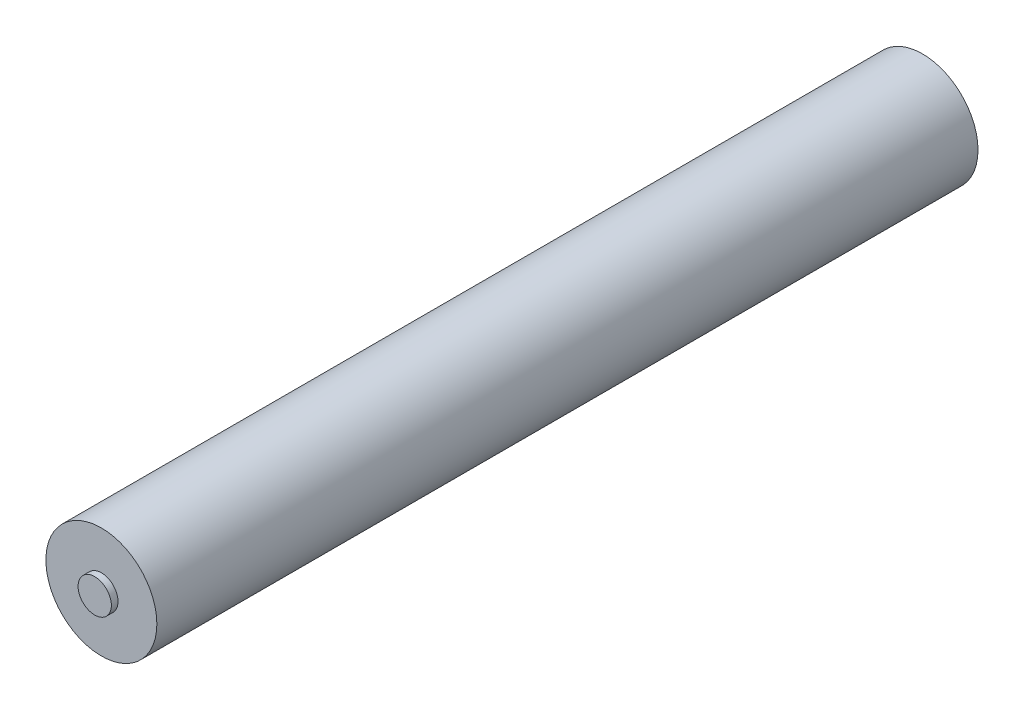
ISO-10303-21;
HEADER;
FILE_DESCRIPTION(('STEP AP214'),'2;1');
FILE_NAME('part.step','',(''),(''),'','','');
FILE_SCHEMA(('AUTOMOTIVE_DESIGN { 1 0 10303 214 1 1 1 1 }'));
ENDSEC;
DATA;
#1=APPLICATION_CONTEXT('core data for automotive mechanical design processes');
#2=APPLICATION_PROTOCOL_DEFINITION('international standard','automotive_design',2000,#1);
#3=PRODUCT_CONTEXT('',#1,'mechanical');
#4=PRODUCT('Part','Part','',(#3));
#5=PRODUCT_RELATED_PRODUCT_CATEGORY('part','',(#4));
#6=PRODUCT_DEFINITION_FORMATION('','',#4);
#7=PRODUCT_DEFINITION_CONTEXT('part definition',#1,'design');
#8=PRODUCT_DEFINITION('design','',#6,#7);
#9=PRODUCT_DEFINITION_SHAPE('','',#8);
#10=(LENGTH_UNIT() NAMED_UNIT(*) SI_UNIT(.MILLI.,.METRE.));
#11=(NAMED_UNIT(*) PLANE_ANGLE_UNIT() SI_UNIT($,.RADIAN.));
#12=(NAMED_UNIT(*) SI_UNIT($,.STERADIAN.) SOLID_ANGLE_UNIT());
#13=UNCERTAINTY_MEASURE_WITH_UNIT(LENGTH_MEASURE(1.E-05),#10,'distance_accuracy_value','');
#14=(GEOMETRIC_REPRESENTATION_CONTEXT(3) GLOBAL_UNCERTAINTY_ASSIGNED_CONTEXT((#13)) GLOBAL_UNIT_ASSIGNED_CONTEXT((#10,
#11,#12)) REPRESENTATION_CONTEXT('',''));
#15=CARTESIAN_POINT('',(0.,0.,0.));
#16=DIRECTION('',(0.,0.,1.));
#17=DIRECTION('',(1.,0.,0.));
#18=AXIS2_PLACEMENT_3D('',#15,#16,#17);
#19=CARTESIAN_POINT('',(0.,0.,370.));
#20=DIRECTION('',(0.,0.,-1.));
#21=DIRECTION('',(-1.,0.,0.));
#22=AXIS2_PLACEMENT_3D('',#19,#20,#21);
#23=CYLINDRICAL_SURFACE('',#22,25.);
#24=CARTESIAN_POINT('',(0.,0.,370.));
#25=DIRECTION('',(0.,0.,1.));
#26=DIRECTION('',(1.,0.,0.));
#27=AXIS2_PLACEMENT_3D('',#24,#25,#26);
#28=CIRCLE('',#27,25.);
#29=CARTESIAN_POINT('',(25.,0.,370.));
#30=VERTEX_POINT('',#29);
#31=EDGE_CURVE('E10',#30,#30,#28,.T.);
#32=ORIENTED_EDGE('',*,*,#31,.F.);
#33=EDGE_LOOP('',(#32));
#34=FACE_BOUND('',#33,.T.);
#35=CARTESIAN_POINT('',(0.,0.,0.));
#36=DIRECTION('',(0.,0.,1.));
#37=DIRECTION('',(1.,0.,0.));
#38=AXIS2_PLACEMENT_3D('',#35,#36,#37);
#39=CIRCLE('',#38,25.);
#40=CARTESIAN_POINT('',(25.,0.,0.));
#41=VERTEX_POINT('',#40);
#42=EDGE_CURVE('E34',#41,#41,#39,.T.);
#43=ORIENTED_EDGE('',*,*,#42,.T.);
#44=EDGE_LOOP('',(#43));
#45=FACE_BOUND('',#44,.T.);
#46=ADVANCED_FACE('F31',(#34,#45),#23,.T.);
#47=CARTESIAN_POINT('',(0.,0.,370.));
#48=DIRECTION('',(0.,0.,1.));
#49=DIRECTION('',(1.,0.,0.));
#50=AXIS2_PLACEMENT_3D('',#47,#48,#49);
#51=PLANE('',#50);
#52=CARTESIAN_POINT('',(0.,0.,370.));
#53=DIRECTION('',(0.,0.,1.));
#54=DIRECTION('',(1.,0.,0.));
#55=AXIS2_PLACEMENT_3D('',#52,#53,#54);
#56=CIRCLE('',#55,7.5);
#57=CARTESIAN_POINT('',(7.5,0.,370.));
#58=VERTEX_POINT('',#57);
#59=EDGE_CURVE('E43',#58,#58,#56,.T.);
#60=ORIENTED_EDGE('',*,*,#59,.F.);
#61=EDGE_LOOP('',(#60));
#62=FACE_BOUND('',#61,.T.);
#63=ORIENTED_EDGE('',*,*,#31,.T.);
#64=EDGE_LOOP('',(#63));
#65=FACE_BOUND('',#64,.T.);
#66=ADVANCED_FACE('F58',(#62,#65),#51,.T.);
#67=CARTESIAN_POINT('',(0.,0.,0.));
#68=DIRECTION('',(0.,0.,1.));
#69=DIRECTION('',(1.,0.,0.));
#70=AXIS2_PLACEMENT_3D('',#67,#68,#69);
#71=PLANE('',#70);
#72=ORIENTED_EDGE('',*,*,#42,.F.);
#73=EDGE_LOOP('',(#72));
#74=FACE_BOUND('',#73,.T.);
#75=ADVANCED_FACE('F54',(#74),#71,.F.);
#76=CARTESIAN_POINT('',(0.,0.,373.));
#77=DIRECTION('',(0.,0.,-1.));
#78=DIRECTION('',(-1.,0.,0.));
#79=AXIS2_PLACEMENT_3D('',#76,#77,#78);
#80=CYLINDRICAL_SURFACE('',#79,7.5);
#81=CARTESIAN_POINT('',(0.,0.,373.));
#82=DIRECTION('',(0.,0.,1.));
#83=DIRECTION('',(1.,0.,0.));
#84=AXIS2_PLACEMENT_3D('',#81,#82,#83);
#85=CIRCLE('',#84,7.5);
#86=CARTESIAN_POINT('',(7.5,0.,373.));
#87=VERTEX_POINT('',#86);
#88=EDGE_CURVE('E41',#87,#87,#85,.T.);
#89=ORIENTED_EDGE('',*,*,#88,.F.);
#90=EDGE_LOOP('',(#89));
#91=FACE_BOUND('',#90,.T.);
#92=ORIENTED_EDGE('',*,*,#59,.T.);
#93=EDGE_LOOP('',(#92));
#94=FACE_BOUND('',#93,.T.);
#95=ADVANCED_FACE('F51',(#91,#94),#80,.T.);
#96=CARTESIAN_POINT('',(0.,0.,373.));
#97=DIRECTION('',(0.,0.,1.));
#98=DIRECTION('',(1.,0.,0.));
#99=AXIS2_PLACEMENT_3D('',#96,#97,#98);
#100=PLANE('',#99);
#101=ORIENTED_EDGE('',*,*,#88,.T.);
#102=EDGE_LOOP('',(#101));
#103=FACE_BOUND('',#102,.T.);
#104=ADVANCED_FACE('F49',(#103),#100,.T.);
#105=CLOSED_SHELL('',(#46,#66,#75,#95,#104));
#106=MANIFOLD_SOLID_BREP('B2',#105);
#107=ADVANCED_BREP_SHAPE_REPRESENTATION('',(#18,#106),#14);
#108=SHAPE_DEFINITION_REPRESENTATION(#9,#107);
ENDSEC;
END-ISO-10303-21;
